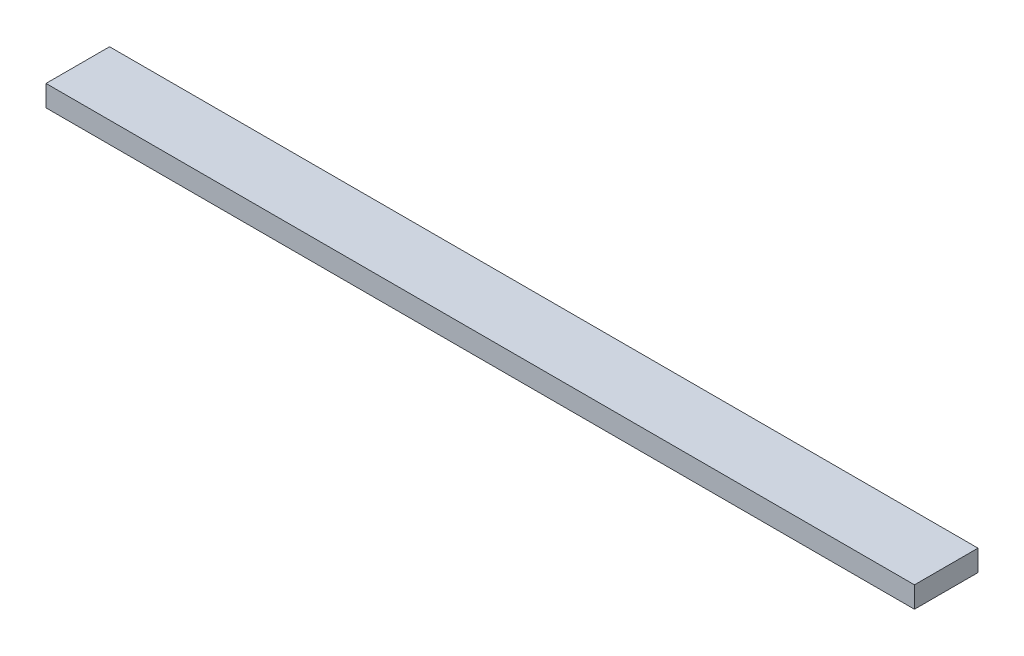
ISO-10303-21;
HEADER;
FILE_DESCRIPTION(('STEP AP214'),'2;1');
FILE_NAME('part.step','',(''),(''),'','','');
FILE_SCHEMA(('AUTOMOTIVE_DESIGN { 1 0 10303 214 1 1 1 1 }'));
ENDSEC;
DATA;
#1=APPLICATION_CONTEXT('core data for automotive mechanical design processes');
#2=APPLICATION_PROTOCOL_DEFINITION('international standard','automotive_design',2000,#1);
#3=PRODUCT_CONTEXT('',#1,'mechanical');
#4=PRODUCT('Part','Part','',(#3));
#5=PRODUCT_RELATED_PRODUCT_CATEGORY('part','',(#4));
#6=PRODUCT_DEFINITION_FORMATION('','',#4);
#7=PRODUCT_DEFINITION_CONTEXT('part definition',#1,'design');
#8=PRODUCT_DEFINITION('design','',#6,#7);
#9=PRODUCT_DEFINITION_SHAPE('','',#8);
#10=(LENGTH_UNIT() NAMED_UNIT(*) SI_UNIT(.MILLI.,.METRE.));
#11=(NAMED_UNIT(*) PLANE_ANGLE_UNIT() SI_UNIT($,.RADIAN.));
#12=(NAMED_UNIT(*) SI_UNIT($,.STERADIAN.) SOLID_ANGLE_UNIT());
#13=UNCERTAINTY_MEASURE_WITH_UNIT(LENGTH_MEASURE(1.E-05),#10,'distance_accuracy_value','');
#14=(GEOMETRIC_REPRESENTATION_CONTEXT(3) GLOBAL_UNCERTAINTY_ASSIGNED_CONTEXT((#13)) GLOBAL_UNIT_ASSIGNED_CONTEXT((#10,
#11,#12)) REPRESENTATION_CONTEXT('',''));
#15=CARTESIAN_POINT('',(0.,0.,0.));
#16=DIRECTION('',(0.,0.,1.));
#17=DIRECTION('',(1.,0.,0.));
#18=AXIS2_PLACEMENT_3D('',#15,#16,#17);
#19=CARTESIAN_POINT('',(-205.,10.,-15.));
#20=DIRECTION('',(1.,0.,0.));
#21=DIRECTION('',(0.,0.,-1.));
#22=AXIS2_PLACEMENT_3D('',#19,#20,#21);
#23=PLANE('',#22);
#24=DIRECTION('',(0.,0.,1.));
#25=VECTOR('',#24,1.);
#26=CARTESIAN_POINT('',(-205.,0.,-15.));
#27=LINE('',#26,#25);
#28=CARTESIAN_POINT('',(-205.,0.,-15.));
#29=VERTEX_POINT('',#28);
#30=CARTESIAN_POINT('',(-205.,0.,15.));
#31=VERTEX_POINT('',#30);
#32=EDGE_CURVE('E95',#29,#31,#27,.T.);
#33=ORIENTED_EDGE('',*,*,#32,.T.);
#34=DIRECTION('',(0.,-1.,0.));
#35=VECTOR('',#34,1.);
#36=CARTESIAN_POINT('',(-205.,10.,15.));
#37=LINE('',#36,#35);
#38=CARTESIAN_POINT('',(-205.,10.,15.));
#39=VERTEX_POINT('',#38);
#40=EDGE_CURVE('E11',#39,#31,#37,.T.);
#41=ORIENTED_EDGE('',*,*,#40,.F.);
#42=DIRECTION('',(0.,0.,1.));
#43=VECTOR('',#42,1.);
#44=CARTESIAN_POINT('',(-205.,10.,-15.));
#45=LINE('',#44,#43);
#46=CARTESIAN_POINT('',(-205.,10.,-15.));
#47=VERTEX_POINT('',#46);
#48=EDGE_CURVE('E83',#47,#39,#45,.T.);
#49=ORIENTED_EDGE('',*,*,#48,.F.);
#50=DIRECTION('',(0.,-1.,0.));
#51=VECTOR('',#50,1.);
#52=CARTESIAN_POINT('',(-205.,10.,-15.));
#53=LINE('',#52,#51);
#54=EDGE_CURVE('E91',#47,#29,#53,.T.);
#55=ORIENTED_EDGE('',*,*,#54,.T.);
#56=EDGE_LOOP('',(#33,#41,#49,#55));
#57=FACE_BOUND('',#56,.T.);
#58=ADVANCED_FACE('F32',(#57),#23,.F.);
#59=CARTESIAN_POINT('',(-205.,10.,15.));
#60=DIRECTION('',(0.,0.,-1.));
#61=DIRECTION('',(-1.,0.,0.));
#62=AXIS2_PLACEMENT_3D('',#59,#60,#61);
#63=PLANE('',#62);
#64=DIRECTION('',(1.,0.,0.));
#65=VECTOR('',#64,1.);
#66=CARTESIAN_POINT('',(-205.,0.,15.));
#67=LINE('',#66,#65);
#68=CARTESIAN_POINT('',(205.,0.,15.));
#69=VERTEX_POINT('',#68);
#70=EDGE_CURVE('E87',#31,#69,#67,.T.);
#71=ORIENTED_EDGE('',*,*,#70,.T.);
#72=DIRECTION('',(0.,-1.,0.));
#73=VECTOR('',#72,1.);
#74=CARTESIAN_POINT('',(205.,10.,15.));
#75=LINE('',#74,#73);
#76=CARTESIAN_POINT('',(205.,10.,15.));
#77=VERTEX_POINT('',#76);
#78=EDGE_CURVE('E40',#77,#69,#75,.T.);
#79=ORIENTED_EDGE('',*,*,#78,.F.);
#80=DIRECTION('',(1.,0.,0.));
#81=VECTOR('',#80,1.);
#82=CARTESIAN_POINT('',(-205.,10.,15.));
#83=LINE('',#82,#81);
#84=EDGE_CURVE('E78',#39,#77,#83,.T.);
#85=ORIENTED_EDGE('',*,*,#84,.F.);
#86=ORIENTED_EDGE('',*,*,#40,.T.);
#87=EDGE_LOOP('',(#71,#79,#85,#86));
#88=FACE_BOUND('',#87,.T.);
#89=ADVANCED_FACE('F86',(#88),#63,.F.);
#90=CARTESIAN_POINT('',(205.,10.,-15.));
#91=DIRECTION('',(-1.,0.,0.));
#92=DIRECTION('',(0.,0.,1.));
#93=AXIS2_PLACEMENT_3D('',#90,#91,#92);
#94=PLANE('',#93);
#95=DIRECTION('',(0.,0.,-1.));
#96=VECTOR('',#95,1.);
#97=CARTESIAN_POINT('',(205.,0.,-15.));
#98=LINE('',#97,#96);
#99=CARTESIAN_POINT('',(205.,0.,-15.));
#100=VERTEX_POINT('',#99);
#101=EDGE_CURVE('E65',#69,#100,#98,.T.);
#102=ORIENTED_EDGE('',*,*,#101,.T.);
#103=DIRECTION('',(0.,-1.,0.));
#104=VECTOR('',#103,1.);
#105=CARTESIAN_POINT('',(205.,10.,-15.));
#106=LINE('',#105,#104);
#107=CARTESIAN_POINT('',(205.,10.,-15.));
#108=VERTEX_POINT('',#107);
#109=EDGE_CURVE('E88',#108,#100,#106,.T.);
#110=ORIENTED_EDGE('',*,*,#109,.F.);
#111=DIRECTION('',(0.,0.,-1.));
#112=VECTOR('',#111,1.);
#113=CARTESIAN_POINT('',(205.,10.,-15.));
#114=LINE('',#113,#112);
#115=EDGE_CURVE('E81',#77,#108,#114,.T.);
#116=ORIENTED_EDGE('',*,*,#115,.F.);
#117=ORIENTED_EDGE('',*,*,#78,.T.);
#118=EDGE_LOOP('',(#102,#110,#116,#117));
#119=FACE_BOUND('',#118,.T.);
#120=ADVANCED_FACE('F89',(#119),#94,.F.);
#121=CARTESIAN_POINT('',(-205.,10.,-15.));
#122=DIRECTION('',(0.,0.,1.));
#123=DIRECTION('',(1.,0.,0.));
#124=AXIS2_PLACEMENT_3D('',#121,#122,#123);
#125=PLANE('',#124);
#126=DIRECTION('',(-1.,0.,0.));
#127=VECTOR('',#126,1.);
#128=CARTESIAN_POINT('',(-205.,0.,-15.));
#129=LINE('',#128,#127);
#130=EDGE_CURVE('E71',#100,#29,#129,.T.);
#131=ORIENTED_EDGE('',*,*,#130,.T.);
#132=ORIENTED_EDGE('',*,*,#54,.F.);
#133=DIRECTION('',(-1.,0.,0.));
#134=VECTOR('',#133,1.);
#135=CARTESIAN_POINT('',(-205.,10.,-15.));
#136=LINE('',#135,#134);
#137=EDGE_CURVE('E48',#108,#47,#136,.T.);
#138=ORIENTED_EDGE('',*,*,#137,.F.);
#139=ORIENTED_EDGE('',*,*,#109,.T.);
#140=EDGE_LOOP('',(#131,#132,#138,#139));
#141=FACE_BOUND('',#140,.T.);
#142=ADVANCED_FACE('F102',(#141),#125,.F.);
#143=CARTESIAN_POINT('',(0.,10.,0.));
#144=DIRECTION('',(0.,1.,0.));
#145=DIRECTION('',(0.,0.,1.));
#146=AXIS2_PLACEMENT_3D('',#143,#144,#145);
#147=PLANE('',#146);
#148=ORIENTED_EDGE('',*,*,#48,.T.);
#149=ORIENTED_EDGE('',*,*,#84,.T.);
#150=ORIENTED_EDGE('',*,*,#115,.T.);
#151=ORIENTED_EDGE('',*,*,#137,.T.);
#152=EDGE_LOOP('',(#148,#149,#150,#151));
#153=FACE_BOUND('',#152,.T.);
#154=ADVANCED_FACE('F79',(#153),#147,.T.);
#155=CARTESIAN_POINT('',(0.,0.,0.));
#156=DIRECTION('',(0.,1.,0.));
#157=DIRECTION('',(0.,0.,1.));
#158=AXIS2_PLACEMENT_3D('',#155,#156,#157);
#159=PLANE('',#158);
#160=ORIENTED_EDGE('',*,*,#32,.F.);
#161=ORIENTED_EDGE('',*,*,#130,.F.);
#162=ORIENTED_EDGE('',*,*,#101,.F.);
#163=ORIENTED_EDGE('',*,*,#70,.F.);
#164=EDGE_LOOP('',(#160,#161,#162,#163));
#165=FACE_BOUND('',#164,.T.);
#166=ADVANCED_FACE('F105',(#165),#159,.F.);
#167=CLOSED_SHELL('',(#58,#89,#120,#142,#154,#166));
#168=MANIFOLD_SOLID_BREP('B2',#167);
#169=ADVANCED_BREP_SHAPE_REPRESENTATION('',(#18,#168),#14);
#170=SHAPE_DEFINITION_REPRESENTATION(#9,#169);
ENDSEC;
END-ISO-10303-21;
